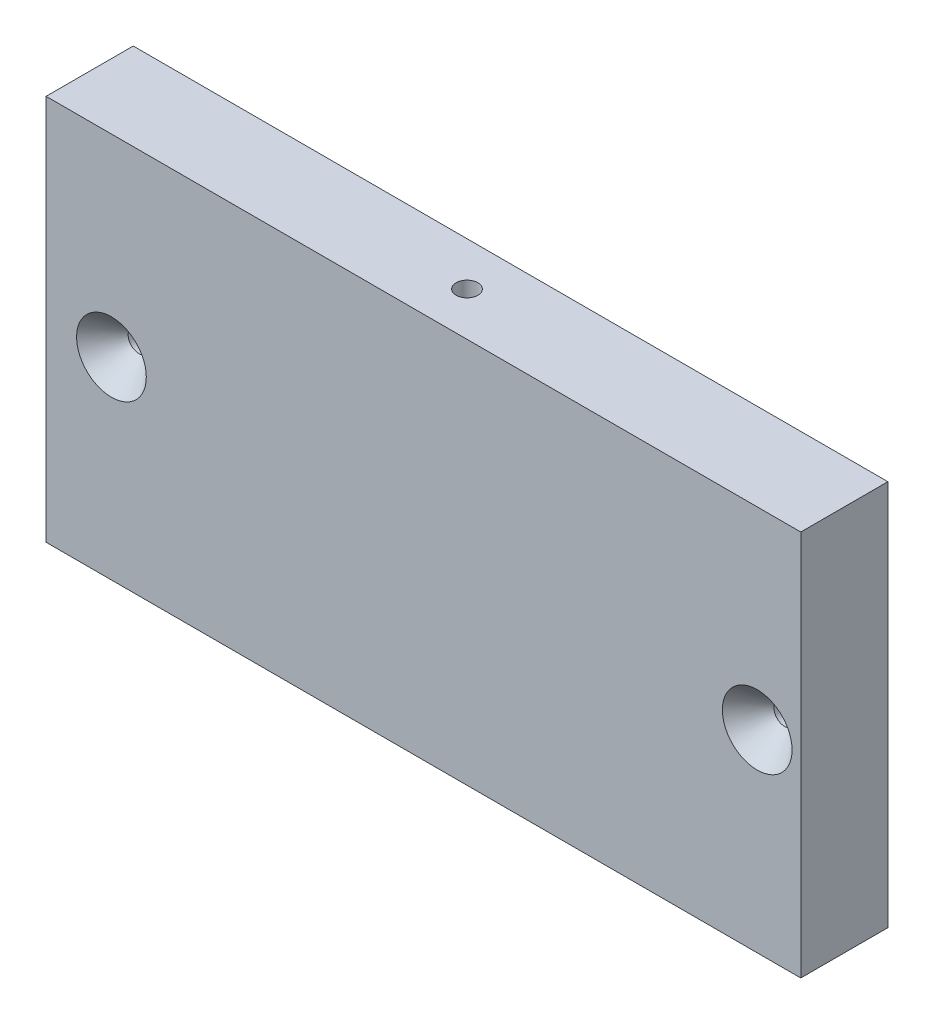
ISO-10303-21;
HEADER;
FILE_DESCRIPTION(('STEP AP214'),'2;1');
FILE_NAME('part.step','',(''),(''),'','','');
FILE_SCHEMA(('AUTOMOTIVE_DESIGN { 1 0 10303 214 1 1 1 1 }'));
ENDSEC;
DATA;
#1=APPLICATION_CONTEXT('core data for automotive mechanical design processes');
#2=APPLICATION_PROTOCOL_DEFINITION('international standard','automotive_design',2000,#1);
#3=PRODUCT_CONTEXT('',#1,'mechanical');
#4=PRODUCT('Part','Part','',(#3));
#5=PRODUCT_RELATED_PRODUCT_CATEGORY('part','',(#4));
#6=PRODUCT_DEFINITION_FORMATION('','',#4);
#7=PRODUCT_DEFINITION_CONTEXT('part definition',#1,'design');
#8=PRODUCT_DEFINITION('design','',#6,#7);
#9=PRODUCT_DEFINITION_SHAPE('','',#8);
#10=(LENGTH_UNIT() NAMED_UNIT(*) SI_UNIT(.MILLI.,.METRE.));
#11=(NAMED_UNIT(*) PLANE_ANGLE_UNIT() SI_UNIT($,.RADIAN.));
#12=(NAMED_UNIT(*) SI_UNIT($,.STERADIAN.) SOLID_ANGLE_UNIT());
#13=UNCERTAINTY_MEASURE_WITH_UNIT(LENGTH_MEASURE(1.E-05),#10,'distance_accuracy_value','');
#14=(GEOMETRIC_REPRESENTATION_CONTEXT(3) GLOBAL_UNCERTAINTY_ASSIGNED_CONTEXT((#13)) GLOBAL_UNIT_ASSIGNED_CONTEXT((#10,
#11,#12)) REPRESENTATION_CONTEXT('',''));
#15=CARTESIAN_POINT('',(0.,0.,0.));
#16=DIRECTION('',(0.,0.,1.));
#17=DIRECTION('',(1.,0.,0.));
#18=AXIS2_PLACEMENT_3D('',#15,#16,#17);
#19=CARTESIAN_POINT('',(-341.304465963193,69.0000000000062,-12.699999999999));
#20=DIRECTION('',(0.,1.00000000000005,0.));
#21=DIRECTION('',(0.,0.,1.00000000000002));
#22=AXIS2_PLACEMENT_3D('',#19,#20,#21);
#23=PLANE('',#22);
#24=CARTESIAN_POINT('',(-286.304465963193,69.0000000000062,-6.34999999999853));
#25=DIRECTION('',(0.,1.00000000000005,0.));
#26=DIRECTION('',(0.,0.,1.00000000000002));
#27=AXIS2_PLACEMENT_3D('',#24,#25,#26);
#28=CIRCLE('',#27,1.58750000000002);
#29=CARTESIAN_POINT('',(-286.304465963193,69.0000000000062,-4.76249999999847));
#30=VERTEX_POINT('',#29);
#31=EDGE_CURVE('E37',#30,#30,#28,.T.);
#32=ORIENTED_EDGE('',*,*,#31,.F.);
#33=EDGE_LOOP('',(#32));
#34=FACE_BOUND('',#33,.T.);
#35=DIRECTION('',(-1.,0.,0.));
#36=VECTOR('',#35,1.);
#37=CARTESIAN_POINT('',(-341.304465963192,69.0000000000071,1.45890244329649E-12));
#38=LINE('',#37,#36);
#39=CARTESIAN_POINT('',(-231.304465963193,69.0000000000068,1.24032728532342E-12));
#40=VERTEX_POINT('',#39);
#41=CARTESIAN_POINT('',(-341.304465963192,69.0000000000071,1.45890244329649E-12));
#42=VERTEX_POINT('',#41);
#43=EDGE_CURVE('E120',#40,#42,#38,.T.);
#44=ORIENTED_EDGE('',*,*,#43,.F.);
#45=DIRECTION('',(0.,0.,1.00000000000002));
#46=VECTOR('',#45,1.);
#47=CARTESIAN_POINT('',(-231.304465963195,69.0000000000064,-12.6999999999988));
#48=LINE('',#47,#46);
#49=CARTESIAN_POINT('',(-231.304465963195,69.0000000000064,-12.6999999999988));
#50=VERTEX_POINT('',#49);
#51=EDGE_CURVE('E11',#50,#40,#48,.T.);
#52=ORIENTED_EDGE('',*,*,#51,.F.);
#53=DIRECTION('',(-1.,0.,0.));
#54=VECTOR('',#53,1.);
#55=CARTESIAN_POINT('',(-341.304465963193,69.0000000000062,-12.699999999999));
#56=LINE('',#55,#54);
#57=CARTESIAN_POINT('',(-341.304465963193,69.0000000000062,-12.699999999999));
#58=VERTEX_POINT('',#57);
#59=EDGE_CURVE('E111',#50,#58,#56,.T.);
#60=ORIENTED_EDGE('',*,*,#59,.T.);
#61=DIRECTION('',(0.,0.,1.00000000000002));
#62=VECTOR('',#61,1.);
#63=CARTESIAN_POINT('',(-341.304465963193,69.0000000000062,-12.699999999999));
#64=LINE('',#63,#62);
#65=EDGE_CURVE('E78',#58,#42,#64,.T.);
#66=ORIENTED_EDGE('',*,*,#65,.T.);
#67=EDGE_LOOP('',(#44,#52,#60,#66));
#68=FACE_BOUND('',#67,.T.);
#69=ADVANCED_FACE('F34',(#34,#68),#23,.T.);
#70=CARTESIAN_POINT('',(-231.304465963195,12.7000000000036,-12.7000000000004));
#71=DIRECTION('',(0.999999999999999,0.,0.));
#72=DIRECTION('',(0.,0.,-1.00000000000002));
#73=AXIS2_PLACEMENT_3D('',#70,#71,#72);
#74=PLANE('',#73);
#75=DIRECTION('',(0.,1.00000000000005,0.));
#76=VECTOR('',#75,1.);
#77=CARTESIAN_POINT('',(-231.304465963193,12.7000000000006,2.55004350968591E-13));
#78=LINE('',#77,#76);
#79=CARTESIAN_POINT('',(-231.304465963193,12.7000000000006,2.55004350968591E-13));
#80=VERTEX_POINT('',#79);
#81=EDGE_CURVE('E114',#80,#40,#78,.T.);
#82=ORIENTED_EDGE('',*,*,#81,.F.);
#83=DIRECTION('',(0.,0.,1.00000000000002));
#84=VECTOR('',#83,1.);
#85=CARTESIAN_POINT('',(-231.304465963195,12.7000000000036,-12.7000000000004));
#86=LINE('',#85,#84);
#87=CARTESIAN_POINT('',(-231.304465963195,12.7000000000036,-12.7000000000004));
#88=VERTEX_POINT('',#87);
#89=EDGE_CURVE('E43',#88,#80,#86,.T.);
#90=ORIENTED_EDGE('',*,*,#89,.F.);
#91=DIRECTION('',(0.,1.00000000000005,0.));
#92=VECTOR('',#91,1.);
#93=CARTESIAN_POINT('',(-231.304465963195,12.7000000000036,-12.7000000000004));
#94=LINE('',#93,#92);
#95=EDGE_CURVE('E118',#88,#50,#94,.T.);
#96=ORIENTED_EDGE('',*,*,#95,.T.);
#97=ORIENTED_EDGE('',*,*,#51,.T.);
#98=EDGE_LOOP('',(#82,#90,#96,#97));
#99=FACE_BOUND('',#98,.T.);
#100=ADVANCED_FACE('F156',(#99),#74,.T.);
#101=CARTESIAN_POINT('',(-231.304465963195,12.7000000000036,-12.7000000000004));
#102=DIRECTION('',(0.,-1.00000000000005,0.));
#103=DIRECTION('',(1.,0.,0.));
#104=AXIS2_PLACEMENT_3D('',#101,#102,#103);
#105=PLANE('',#104);
#106=DIRECTION('',(1.,0.,0.));
#107=VECTOR('',#106,1.);
#108=CARTESIAN_POINT('',(-231.304465963193,12.7000000000006,2.55004350968591E-13));
#109=LINE('',#108,#107);
#110=CARTESIAN_POINT('',(-341.304465963192,12.6999999999988,4.04190569902596E-13));
#111=VERTEX_POINT('',#110);
#112=EDGE_CURVE('E126',#111,#80,#109,.T.);
#113=ORIENTED_EDGE('',*,*,#112,.F.);
#114=DIRECTION('',(0.,0.,1.00000000000002));
#115=VECTOR('',#114,1.);
#116=CARTESIAN_POINT('',(-341.304465963189,12.7000000000008,-12.7000000000002));
#117=LINE('',#116,#115);
#118=CARTESIAN_POINT('',(-341.304465963189,12.7000000000008,-12.7000000000002));
#119=VERTEX_POINT('',#118);
#120=EDGE_CURVE('E131',#119,#111,#117,.T.);
#121=ORIENTED_EDGE('',*,*,#120,.F.);
#122=DIRECTION('',(1.,0.,0.));
#123=VECTOR('',#122,1.);
#124=CARTESIAN_POINT('',(-231.304465963195,12.7000000000036,-12.7000000000004));
#125=LINE('',#124,#123);
#126=EDGE_CURVE('E116',#119,#88,#125,.T.);
#127=ORIENTED_EDGE('',*,*,#126,.T.);
#128=ORIENTED_EDGE('',*,*,#89,.T.);
#129=EDGE_LOOP('',(#113,#121,#127,#128));
#130=FACE_BOUND('',#129,.T.);
#131=ADVANCED_FACE('F161',(#130),#105,.T.);
#132=CARTESIAN_POINT('',(-341.304465963189,12.7000000000008,-12.7000000000002));
#133=DIRECTION('',(-0.999999999999999,0.,0.));
#134=DIRECTION('',(0.,0.,1.00000000000002));
#135=AXIS2_PLACEMENT_3D('',#132,#133,#134);
#136=PLANE('',#135);
#137=DIRECTION('',(0.,-1.00000000000005,0.));
#138=VECTOR('',#137,1.);
#139=CARTESIAN_POINT('',(-341.304465963192,12.6999999999988,4.04190569902596E-13));
#140=LINE('',#139,#138);
#141=EDGE_CURVE('E123',#42,#111,#140,.T.);
#142=ORIENTED_EDGE('',*,*,#141,.F.);
#143=ORIENTED_EDGE('',*,*,#65,.F.);
#144=DIRECTION('',(0.,-1.00000000000005,0.));
#145=VECTOR('',#144,1.);
#146=CARTESIAN_POINT('',(-341.304465963189,12.7000000000008,-12.7000000000002));
#147=LINE('',#146,#145);
#148=EDGE_CURVE('E113',#58,#119,#147,.T.);
#149=ORIENTED_EDGE('',*,*,#148,.T.);
#150=ORIENTED_EDGE('',*,*,#120,.T.);
#151=EDGE_LOOP('',(#142,#143,#149,#150));
#152=FACE_BOUND('',#151,.T.);
#153=ADVANCED_FACE('F169',(#152),#136,.T.);
#154=CARTESIAN_POINT('',(1.11022302462516E-13,0.,-12.7000000000002));
#155=DIRECTION('',(0.,0.,1.00000000000002));
#156=DIRECTION('',(0.999999999999999,0.,0.));
#157=AXIS2_PLACEMENT_3D('',#154,#155,#156);
#158=PLANE('',#157);
#159=CARTESIAN_POINT('',(-237.654465963195,40.8500000000055,-12.6999999999995));
#160=DIRECTION('',(0.,0.,1.00000000000002));
#161=DIRECTION('',(0.999999999999999,0.,0.));
#162=AXIS2_PLACEMENT_3D('',#159,#160,#161);
#163=CIRCLE('',#162,1.58749999999999);
#164=CARTESIAN_POINT('',(-236.066965963195,40.8500000000055,-12.6999999999995));
#165=VERTEX_POINT('',#164);
#166=EDGE_CURVE('E103',#165,#165,#163,.T.);
#167=ORIENTED_EDGE('',*,*,#166,.T.);
#168=EDGE_LOOP('',(#167));
#169=FACE_BOUND('',#168,.T.);
#170=CARTESIAN_POINT('',(-331.779465963192,40.8500000000054,-12.6999999999997));
#171=DIRECTION('',(0.,0.,1.00000000000002));
#172=DIRECTION('',(0.999999999999999,0.,0.));
#173=AXIS2_PLACEMENT_3D('',#170,#171,#172);
#174=CIRCLE('',#173,1.58750000000002);
#175=CARTESIAN_POINT('',(-330.191965963192,40.8500000000054,-12.6999999999997));
#176=VERTEX_POINT('',#175);
#177=EDGE_CURVE('E110',#176,#176,#174,.T.);
#178=ORIENTED_EDGE('',*,*,#177,.T.);
#179=EDGE_LOOP('',(#178));
#180=FACE_BOUND('',#179,.T.);
#181=ORIENTED_EDGE('',*,*,#59,.F.);
#182=ORIENTED_EDGE('',*,*,#95,.F.);
#183=ORIENTED_EDGE('',*,*,#126,.F.);
#184=ORIENTED_EDGE('',*,*,#148,.F.);
#185=EDGE_LOOP('',(#181,#182,#183,#184));
#186=FACE_BOUND('',#185,.T.);
#187=ADVANCED_FACE('F138',(#169,#180,#186),#158,.F.);
#188=CARTESIAN_POINT('',(0.,0.,0.));
#189=DIRECTION('',(0.,0.,1.00000000000002));
#190=DIRECTION('',(0.999999999999999,0.,0.));
#191=AXIS2_PLACEMENT_3D('',#188,#189,#190);
#192=PLANE('',#191);
#193=CARTESIAN_POINT('',(-237.654465963193,40.850000000006,8.15320033709099E-13));
#194=DIRECTION('',(0.,0.,1.00000000000002));
#195=DIRECTION('',(0.999999999999999,0.,0.));
#196=AXIS2_PLACEMENT_3D('',#193,#194,#195);
#197=CIRCLE('',#196,5.08);
#198=CARTESIAN_POINT('',(-232.574465963193,40.850000000006,8.17858003543393E-13));
#199=VERTEX_POINT('',#198);
#200=EDGE_CURVE('E96',#199,#199,#197,.T.);
#201=ORIENTED_EDGE('',*,*,#200,.F.);
#202=EDGE_LOOP('',(#201));
#203=FACE_BOUND('',#202,.T.);
#204=CARTESIAN_POINT('',(-331.779465963196,40.8500000000056,8.46545056276682E-13));
#205=DIRECTION('',(0.,0.,1.00000000000002));
#206=DIRECTION('',(0.999999999999999,0.,0.));
#207=AXIS2_PLACEMENT_3D('',#204,#205,#206);
#208=CIRCLE('',#207,5.08000000000003);
#209=CARTESIAN_POINT('',(-326.699465963196,40.8500000000056,8.49083026110975E-13));
#210=VERTEX_POINT('',#209);
#211=EDGE_CURVE('E104',#210,#210,#208,.T.);
#212=ORIENTED_EDGE('',*,*,#211,.F.);
#213=EDGE_LOOP('',(#212));
#214=FACE_BOUND('',#213,.T.);
#215=ORIENTED_EDGE('',*,*,#43,.T.);
#216=ORIENTED_EDGE('',*,*,#141,.T.);
#217=ORIENTED_EDGE('',*,*,#112,.T.);
#218=ORIENTED_EDGE('',*,*,#81,.T.);
#219=EDGE_LOOP('',(#215,#216,#217,#218));
#220=FACE_BOUND('',#219,.T.);
#221=ADVANCED_FACE('F165',(#203,#214,#220),#192,.T.);
#222=CARTESIAN_POINT('',(-331.779465963196,40.8500000000056,8.46545056276682E-13));
#223=DIRECTION('',(0.,0.,1.00000000000002));
#224=DIRECTION('',(0.999999999999999,0.,0.));
#225=AXIS2_PLACEMENT_3D('',#222,#223,#224);
#226=CYLINDRICAL_SURFACE('',#225,1.58750000000002);
#227=CARTESIAN_POINT('',(-331.779465963197,40.8500000000054,-4.01766166221864));
#228=DIRECTION('',(0.,0.,1.00000000000002));
#229=DIRECTION('',(0.999999999999999,0.,0.));
#230=AXIS2_PLACEMENT_3D('',#227,#228,#229);
#231=CIRCLE('',#230,1.58750000000002);
#232=CARTESIAN_POINT('',(-330.191965963197,40.8500000000054,-4.01766166221864));
#233=VERTEX_POINT('',#232);
#234=EDGE_CURVE('E107',#233,#233,#231,.T.);
#235=ORIENTED_EDGE('',*,*,#234,.T.);
#236=EDGE_LOOP('',(#235));
#237=FACE_BOUND('',#236,.T.);
#238=ORIENTED_EDGE('',*,*,#177,.F.);
#239=EDGE_LOOP('',(#238));
#240=FACE_BOUND('',#239,.T.);
#241=ADVANCED_FACE('F152',(#237,#240),#226,.F.);
#242=CARTESIAN_POINT('',(-331.779465963196,40.8500000000056,8.46545056276682E-13));
#243=DIRECTION('',(0.,0.,1.00000000000002));
#244=DIRECTION('',(0.999999999999999,0.,0.));
#245=AXIS2_PLACEMENT_3D('',#242,#243,#244);
#246=CONICAL_SURFACE('',#245,5.08000000000003,0.715584993317678);
#247=ORIENTED_EDGE('',*,*,#234,.F.);
#248=EDGE_LOOP('',(#247));
#249=FACE_BOUND('',#248,.T.);
#250=ORIENTED_EDGE('',*,*,#211,.T.);
#251=EDGE_LOOP('',(#250));
#252=FACE_BOUND('',#251,.T.);
#253=ADVANCED_FACE('F143',(#249,#252),#246,.F.);
#254=CARTESIAN_POINT('',(-237.654465963193,40.850000000006,8.15320033709099E-13));
#255=DIRECTION('',(0.,0.,1.00000000000002));
#256=DIRECTION('',(0.999999999999999,0.,0.));
#257=AXIS2_PLACEMENT_3D('',#254,#255,#256);
#258=CYLINDRICAL_SURFACE('',#257,1.58749999999999);
#259=CARTESIAN_POINT('',(-237.654465963193,40.8500000000059,-4.01766166221864));
#260=DIRECTION('',(0.,0.,1.00000000000002));
#261=DIRECTION('',(0.999999999999999,0.,0.));
#262=AXIS2_PLACEMENT_3D('',#259,#260,#261);
#263=CIRCLE('',#262,1.58749999999999);
#264=CARTESIAN_POINT('',(-236.066965963193,40.8500000000059,-4.01766166221864));
#265=VERTEX_POINT('',#264);
#266=EDGE_CURVE('E100',#265,#265,#263,.T.);
#267=ORIENTED_EDGE('',*,*,#266,.T.);
#268=EDGE_LOOP('',(#267));
#269=FACE_BOUND('',#268,.T.);
#270=ORIENTED_EDGE('',*,*,#166,.F.);
#271=EDGE_LOOP('',(#270));
#272=FACE_BOUND('',#271,.T.);
#273=ADVANCED_FACE('F141',(#269,#272),#258,.F.);
#274=CARTESIAN_POINT('',(-237.654465963193,40.850000000006,8.15320033709099E-13));
#275=DIRECTION('',(0.,0.,1.00000000000002));
#276=DIRECTION('',(0.999999999999999,0.,0.));
#277=AXIS2_PLACEMENT_3D('',#274,#275,#276);
#278=CONICAL_SURFACE('',#277,5.08,0.715584993317678);
#279=ORIENTED_EDGE('',*,*,#266,.F.);
#280=EDGE_LOOP('',(#279));
#281=FACE_BOUND('',#280,.T.);
#282=ORIENTED_EDGE('',*,*,#200,.T.);
#283=EDGE_LOOP('',(#282));
#284=FACE_BOUND('',#283,.T.);
#285=ADVANCED_FACE('F88',(#281,#284),#278,.F.);
#286=CARTESIAN_POINT('',(-286.304465963193,56.3000000000053,-6.34999999999885));
#287=DIRECTION('',(0.,1.00000000000005,0.));
#288=DIRECTION('',(0.,0.,1.00000000000002));
#289=AXIS2_PLACEMENT_3D('',#286,#287,#288);
#290=CONICAL_SURFACE('',#289,1.58750000000002,1.02974425867666);
#291=CARTESIAN_POINT('',(-286.304465963193,55.3461337672992,-6.34999999999893));
#292=VERTEX_POINT('',#291);
#293=VERTEX_LOOP('',#292);
#294=FACE_BOUND('',#293,.T.);
#295=CARTESIAN_POINT('',(-286.304465963193,56.3000000000053,-6.34999999999885));
#296=DIRECTION('',(0.,1.00000000000005,0.));
#297=DIRECTION('',(0.,0.,1.00000000000002));
#298=AXIS2_PLACEMENT_3D('',#295,#296,#297);
#299=CIRCLE('',#298,1.58750000000002);
#300=CARTESIAN_POINT('',(-286.304465963193,56.3000000000053,-4.7624999999988));
#301=VERTEX_POINT('',#300);
#302=EDGE_CURVE('E92',#301,#301,#299,.T.);
#303=ORIENTED_EDGE('',*,*,#302,.T.);
#304=EDGE_LOOP('',(#303));
#305=FACE_BOUND('',#304,.T.);
#306=ADVANCED_FACE('F84',(#294,#305),#290,.F.);
#307=CARTESIAN_POINT('',(-286.304465963193,88.0500000000065,-6.34999999999781));
#308=DIRECTION('',(0.,1.00000000000005,0.));
#309=DIRECTION('',(0.,0.,1.00000000000002));
#310=AXIS2_PLACEMENT_3D('',#307,#308,#309);
#311=CYLINDRICAL_SURFACE('',#310,1.58750000000002);
#312=ORIENTED_EDGE('',*,*,#31,.T.);
#313=EDGE_LOOP('',(#312));
#314=FACE_BOUND('',#313,.T.);
#315=ORIENTED_EDGE('',*,*,#302,.F.);
#316=EDGE_LOOP('',(#315));
#317=FACE_BOUND('',#316,.T.);
#318=ADVANCED_FACE('F87',(#314,#317),#311,.F.);
#319=CLOSED_SHELL('',(#69,#100,#131,#153,#187,#221,#241,#253,#273,#285,#306,#318));
#320=MANIFOLD_SOLID_BREP('B2',#319);
#321=ADVANCED_BREP_SHAPE_REPRESENTATION('',(#18,#320),#14);
#322=SHAPE_DEFINITION_REPRESENTATION(#9,#321);
ENDSEC;
END-ISO-10303-21;
